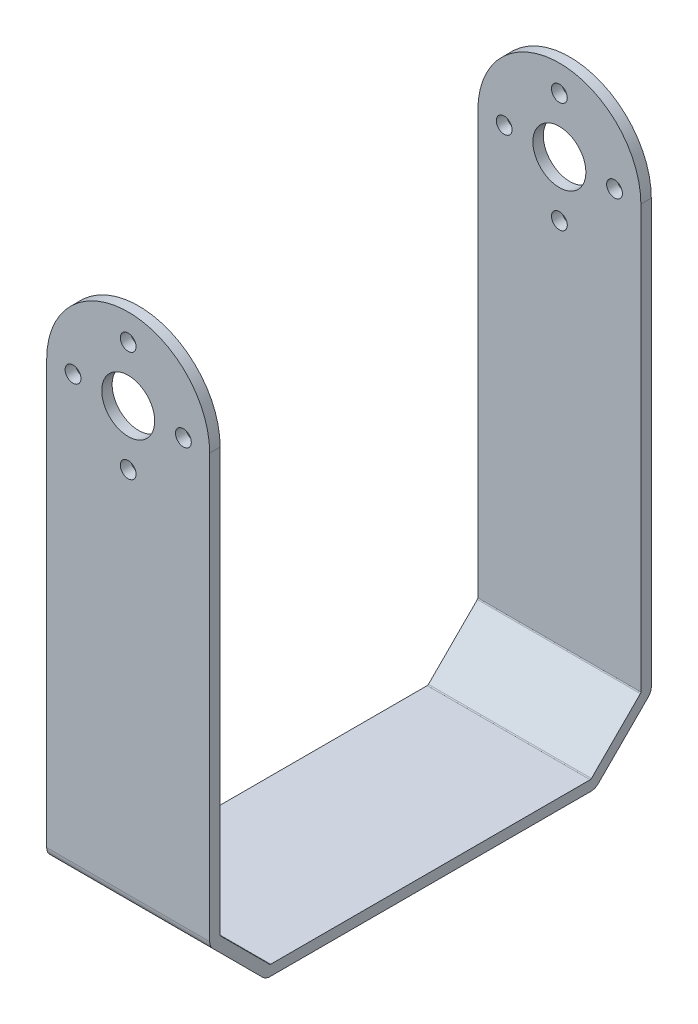
ISO-10303-21;
HEADER;
FILE_DESCRIPTION(('STEP AP214'),'2;1');
FILE_NAME('part.step','',(''),(''),'','','');
FILE_SCHEMA(('AUTOMOTIVE_DESIGN { 1 0 10303 214 1 1 1 1 }'));
ENDSEC;
DATA;
#1=APPLICATION_CONTEXT('core data for automotive mechanical design processes');
#2=APPLICATION_PROTOCOL_DEFINITION('international standard','automotive_design',2000,#1);
#3=PRODUCT_CONTEXT('',#1,'mechanical');
#4=PRODUCT('Part','Part','',(#3));
#5=PRODUCT_RELATED_PRODUCT_CATEGORY('part','',(#4));
#6=PRODUCT_DEFINITION_FORMATION('','',#4);
#7=PRODUCT_DEFINITION_CONTEXT('part definition',#1,'design');
#8=PRODUCT_DEFINITION('design','',#6,#7);
#9=PRODUCT_DEFINITION_SHAPE('','',#8);
#10=(LENGTH_UNIT() NAMED_UNIT(*) SI_UNIT(.MILLI.,.METRE.));
#11=(NAMED_UNIT(*) PLANE_ANGLE_UNIT() SI_UNIT($,.RADIAN.));
#12=(NAMED_UNIT(*) SI_UNIT($,.STERADIAN.) SOLID_ANGLE_UNIT());
#13=UNCERTAINTY_MEASURE_WITH_UNIT(LENGTH_MEASURE(1.E-05),#10,'distance_accuracy_value','');
#14=(GEOMETRIC_REPRESENTATION_CONTEXT(3) GLOBAL_UNCERTAINTY_ASSIGNED_CONTEXT((#13)) GLOBAL_UNIT_ASSIGNED_CONTEXT((#10,
#11,#12)) REPRESENTATION_CONTEXT('',''));
#15=CARTESIAN_POINT('',(0.,0.,0.));
#16=DIRECTION('',(0.,0.,1.));
#17=DIRECTION('',(1.,0.,0.));
#18=AXIS2_PLACEMENT_3D('',#15,#16,#17);
#19=CARTESIAN_POINT('',(24.6126,0.,0.));
#20=DIRECTION('',(0.,0.,-1.));
#21=DIRECTION('',(-1.,0.,0.));
#22=AXIS2_PLACEMENT_3D('',#19,#20,#21);
#23=PLANE('',#22);
#24=CARTESIAN_POINT('',(20.6375,73.025,0.));
#25=DIRECTION('',(0.,0.,1.));
#26=DIRECTION('',(1.,0.,0.));
#27=AXIS2_PLACEMENT_3D('',#24,#25,#26);
#28=CIRCLE('',#27,1.1938);
#29=CARTESIAN_POINT('',(21.8313,73.025,0.));
#30=VERTEX_POINT('',#29);
#31=EDGE_CURVE('E516',#30,#30,#28,.T.);
#32=ORIENTED_EDGE('',*,*,#31,.F.);
#33=EDGE_LOOP('',(#32));
#34=FACE_BOUND('',#33,.T.);
#35=CARTESIAN_POINT('',(12.3063,64.6938,0.));
#36=DIRECTION('',(0.,0.,1.));
#37=DIRECTION('',(1.,0.,0.));
#38=AXIS2_PLACEMENT_3D('',#35,#36,#37);
#39=CIRCLE('',#38,1.1938);
#40=CARTESIAN_POINT('',(13.5001,64.6938,0.));
#41=VERTEX_POINT('',#40);
#42=EDGE_CURVE('E419',#41,#41,#39,.T.);
#43=ORIENTED_EDGE('',*,*,#42,.F.);
#44=EDGE_LOOP('',(#43));
#45=FACE_BOUND('',#44,.T.);
#46=CARTESIAN_POINT('',(3.9751,73.025,0.));
#47=DIRECTION('',(0.,0.,1.));
#48=DIRECTION('',(1.,0.,0.));
#49=AXIS2_PLACEMENT_3D('',#46,#47,#48);
#50=CIRCLE('',#49,1.1938);
#51=CARTESIAN_POINT('',(5.1689,73.025,0.));
#52=VERTEX_POINT('',#51);
#53=EDGE_CURVE('E415',#52,#52,#50,.T.);
#54=ORIENTED_EDGE('',*,*,#53,.F.);
#55=EDGE_LOOP('',(#54));
#56=FACE_BOUND('',#55,.T.);
#57=CARTESIAN_POINT('',(12.3063,81.3562,0.));
#58=DIRECTION('',(0.,0.,1.));
#59=DIRECTION('',(1.,0.,0.));
#60=AXIS2_PLACEMENT_3D('',#57,#58,#59);
#61=CIRCLE('',#60,1.1938);
#62=CARTESIAN_POINT('',(13.5001,81.3562,0.));
#63=VERTEX_POINT('',#62);
#64=EDGE_CURVE('E439',#63,#63,#61,.T.);
#65=ORIENTED_EDGE('',*,*,#64,.F.);
#66=EDGE_LOOP('',(#65));
#67=FACE_BOUND('',#66,.T.);
#68=CARTESIAN_POINT('',(12.3063,73.025,0.));
#69=DIRECTION('',(0.,0.,1.));
#70=DIRECTION('',(1.,0.,0.));
#71=AXIS2_PLACEMENT_3D('',#68,#69,#70);
#72=CIRCLE('',#71,4.0005);
#73=CARTESIAN_POINT('',(16.3068,73.025,0.));
#74=VERTEX_POINT('',#73);
#75=EDGE_CURVE('E449',#74,#74,#72,.T.);
#76=ORIENTED_EDGE('',*,*,#75,.F.);
#77=EDGE_LOOP('',(#76));
#78=FACE_BOUND('',#77,.T.);
#79=DIRECTION('',(0.,-1.,0.));
#80=VECTOR('',#79,1.);
#81=CARTESIAN_POINT('',(0.,0.,0.));
#82=LINE('',#81,#80);
#83=CARTESIAN_POINT('',(0.,73.0123,0.));
#84=VERTEX_POINT('',#83);
#85=CARTESIAN_POINT('',(0.,9.12386051224214,0.));
#86=VERTEX_POINT('',#85);
#87=EDGE_CURVE('E248',#84,#86,#82,.T.);
#88=ORIENTED_EDGE('',*,*,#87,.T.);
#89=DIRECTION('',(1.,0.,0.));
#90=VECTOR('',#89,1.);
#91=CARTESIAN_POINT('',(24.6126,9.12386051224214,0.));
#92=LINE('',#91,#90);
#93=CARTESIAN_POINT('',(24.6126,9.12386051224214,0.));
#94=VERTEX_POINT('',#93);
#95=EDGE_CURVE('E337',#86,#94,#92,.T.);
#96=ORIENTED_EDGE('',*,*,#95,.T.);
#97=DIRECTION('',(0.,-1.,0.));
#98=VECTOR('',#97,1.);
#99=CARTESIAN_POINT('',(24.6126,0.,0.));
#100=LINE('',#99,#98);
#101=CARTESIAN_POINT('',(24.6126,73.0123,0.));
#102=VERTEX_POINT('',#101);
#103=EDGE_CURVE('E186',#102,#94,#100,.T.);
#104=ORIENTED_EDGE('',*,*,#103,.F.);
#105=CARTESIAN_POINT('',(12.3063,73.0123,0.));
#106=DIRECTION('',(0.,0.,1.));
#107=DIRECTION('',(1.,0.,0.));
#108=AXIS2_PLACEMENT_3D('',#105,#106,#107);
#109=CIRCLE('',#108,12.3063);
#110=EDGE_CURVE('E198',#102,#84,#109,.T.);
#111=ORIENTED_EDGE('',*,*,#110,.T.);
#112=EDGE_LOOP('',(#88,#96,#104,#111));
#113=FACE_BOUND('',#112,.T.);
#114=ADVANCED_FACE('F37',(#34,#45,#56,#67,#78,#113),#23,.F.);
#115=CARTESIAN_POINT('',(24.6126,0.,-66.675));
#116=DIRECTION('',(0.,0.,1.));
#117=DIRECTION('',(1.,0.,0.));
#118=AXIS2_PLACEMENT_3D('',#115,#116,#117);
#119=PLANE('',#118);
#120=CARTESIAN_POINT('',(20.6375,73.025,-66.675));
#121=DIRECTION('',(0.,0.,1.));
#122=DIRECTION('',(1.,0.,0.));
#123=AXIS2_PLACEMENT_3D('',#120,#121,#122);
#124=CIRCLE('',#123,1.1938);
#125=CARTESIAN_POINT('',(21.8313,73.025,-66.675));
#126=VERTEX_POINT('',#125);
#127=EDGE_CURVE('E512',#126,#126,#124,.T.);
#128=ORIENTED_EDGE('',*,*,#127,.T.);
#129=EDGE_LOOP('',(#128));
#130=FACE_BOUND('',#129,.T.);
#131=CARTESIAN_POINT('',(12.3063,64.6938,-66.675));
#132=DIRECTION('',(0.,0.,1.));
#133=DIRECTION('',(1.,0.,0.));
#134=AXIS2_PLACEMENT_3D('',#131,#132,#133);
#135=CIRCLE('',#134,1.1938);
#136=CARTESIAN_POINT('',(13.5001,64.6938,-66.675));
#137=VERTEX_POINT('',#136);
#138=EDGE_CURVE('E409',#137,#137,#135,.T.);
#139=ORIENTED_EDGE('',*,*,#138,.T.);
#140=EDGE_LOOP('',(#139));
#141=FACE_BOUND('',#140,.T.);
#142=CARTESIAN_POINT('',(3.9751,73.025,-66.675));
#143=DIRECTION('',(0.,0.,1.));
#144=DIRECTION('',(1.,0.,0.));
#145=AXIS2_PLACEMENT_3D('',#142,#143,#144);
#146=CIRCLE('',#145,1.1938);
#147=CARTESIAN_POINT('',(5.1689,73.025,-66.675));
#148=VERTEX_POINT('',#147);
#149=EDGE_CURVE('E404',#148,#148,#146,.T.);
#150=ORIENTED_EDGE('',*,*,#149,.T.);
#151=EDGE_LOOP('',(#150));
#152=FACE_BOUND('',#151,.T.);
#153=CARTESIAN_POINT('',(12.3063,81.3562,-66.675));
#154=DIRECTION('',(0.,0.,1.));
#155=DIRECTION('',(1.,0.,0.));
#156=AXIS2_PLACEMENT_3D('',#153,#154,#155);
#157=CIRCLE('',#156,1.1938);
#158=CARTESIAN_POINT('',(13.5001,81.3562,-66.675));
#159=VERTEX_POINT('',#158);
#160=EDGE_CURVE('E399',#159,#159,#157,.T.);
#161=ORIENTED_EDGE('',*,*,#160,.T.);
#162=EDGE_LOOP('',(#161));
#163=FACE_BOUND('',#162,.T.);
#164=CARTESIAN_POINT('',(12.3063,73.025,-66.675));
#165=DIRECTION('',(0.,0.,1.));
#166=DIRECTION('',(1.,0.,0.));
#167=AXIS2_PLACEMENT_3D('',#164,#165,#166);
#168=CIRCLE('',#167,4.0005);
#169=CARTESIAN_POINT('',(16.3068,73.025,-66.675));
#170=VERTEX_POINT('',#169);
#171=EDGE_CURVE('E393',#170,#170,#168,.T.);
#172=ORIENTED_EDGE('',*,*,#171,.T.);
#173=EDGE_LOOP('',(#172));
#174=FACE_BOUND('',#173,.T.);
#175=DIRECTION('',(0.,1.,0.));
#176=VECTOR('',#175,1.);
#177=CARTESIAN_POINT('',(24.6126,0.,-66.675));
#178=LINE('',#177,#176);
#179=CARTESIAN_POINT('',(24.6126,9.12386051224214,-66.675));
#180=VERTEX_POINT('',#179);
#181=CARTESIAN_POINT('',(24.6126,73.0123,-66.675));
#182=VERTEX_POINT('',#181);
#183=EDGE_CURVE('E280',#180,#182,#178,.T.);
#184=ORIENTED_EDGE('',*,*,#183,.F.);
#185=DIRECTION('',(1.,0.,0.));
#186=VECTOR('',#185,1.);
#187=CARTESIAN_POINT('',(0.,9.12386051224214,-66.675));
#188=LINE('',#187,#186);
#189=CARTESIAN_POINT('',(0.,9.12386051224214,-66.675));
#190=VERTEX_POINT('',#189);
#191=EDGE_CURVE('E181',#180,#190,#188,.F.);
#192=ORIENTED_EDGE('',*,*,#191,.T.);
#193=DIRECTION('',(0.,1.,0.));
#194=VECTOR('',#193,1.);
#195=CARTESIAN_POINT('',(0.,0.,-66.675));
#196=LINE('',#195,#194);
#197=CARTESIAN_POINT('',(0.,73.0123,-66.675));
#198=VERTEX_POINT('',#197);
#199=EDGE_CURVE('E175',#190,#198,#196,.T.);
#200=ORIENTED_EDGE('',*,*,#199,.T.);
#201=CARTESIAN_POINT('',(12.3063,73.0123,-66.675));
#202=DIRECTION('',(0.,0.,1.));
#203=DIRECTION('',(1.,0.,0.));
#204=AXIS2_PLACEMENT_3D('',#201,#202,#203);
#205=CIRCLE('',#204,12.3063);
#206=EDGE_CURVE('E179',#182,#198,#205,.T.);
#207=ORIENTED_EDGE('',*,*,#206,.F.);
#208=EDGE_LOOP('',(#184,#192,#200,#207));
#209=FACE_BOUND('',#208,.T.);
#210=ADVANCED_FACE('F178',(#130,#141,#152,#163,#174,#209),#119,.F.);
#211=CARTESIAN_POINT('',(0.,85.3186,-1.5748));
#212=DIRECTION('',(0.,0.,-1.));
#213=DIRECTION('',(0.,1.,0.));
#214=AXIS2_PLACEMENT_3D('',#211,#212,#213);
#215=PLANE('',#214);
#216=CARTESIAN_POINT('',(20.6375,73.025,-1.5748));
#217=DIRECTION('',(0.,0.,-1.));
#218=DIRECTION('',(0.,1.,0.));
#219=AXIS2_PLACEMENT_3D('',#216,#217,#218);
#220=CIRCLE('',#219,1.1938);
#221=CARTESIAN_POINT('',(20.6375,74.2188,-1.5748));
#222=VERTEX_POINT('',#221);
#223=EDGE_CURVE('E425',#222,#222,#220,.T.);
#224=ORIENTED_EDGE('',*,*,#223,.F.);
#225=EDGE_LOOP('',(#224));
#226=FACE_BOUND('',#225,.T.);
#227=CARTESIAN_POINT('',(12.3063,64.6938,-1.5748));
#228=DIRECTION('',(0.,0.,-1.));
#229=DIRECTION('',(0.,1.,0.));
#230=AXIS2_PLACEMENT_3D('',#227,#228,#229);
#231=CIRCLE('',#230,1.1938);
#232=CARTESIAN_POINT('',(12.3063,65.8876,-1.5748));
#233=VERTEX_POINT('',#232);
#234=EDGE_CURVE('E408',#233,#233,#231,.T.);
#235=ORIENTED_EDGE('',*,*,#234,.F.);
#236=EDGE_LOOP('',(#235));
#237=FACE_BOUND('',#236,.T.);
#238=CARTESIAN_POINT('',(3.9751,73.025,-1.5748));
#239=DIRECTION('',(0.,0.,-1.));
#240=DIRECTION('',(0.,1.,0.));
#241=AXIS2_PLACEMENT_3D('',#238,#239,#240);
#242=CIRCLE('',#241,1.1938);
#243=CARTESIAN_POINT('',(3.9751,74.2188,-1.5748));
#244=VERTEX_POINT('',#243);
#245=EDGE_CURVE('E403',#244,#244,#242,.T.);
#246=ORIENTED_EDGE('',*,*,#245,.F.);
#247=EDGE_LOOP('',(#246));
#248=FACE_BOUND('',#247,.T.);
#249=CARTESIAN_POINT('',(12.3063,81.3562,-1.5748));
#250=DIRECTION('',(0.,0.,-1.));
#251=DIRECTION('',(0.,1.,0.));
#252=AXIS2_PLACEMENT_3D('',#249,#250,#251);
#253=CIRCLE('',#252,1.1938);
#254=CARTESIAN_POINT('',(12.3063,82.55,-1.5748));
#255=VERTEX_POINT('',#254);
#256=EDGE_CURVE('E398',#255,#255,#253,.T.);
#257=ORIENTED_EDGE('',*,*,#256,.F.);
#258=EDGE_LOOP('',(#257));
#259=FACE_BOUND('',#258,.T.);
#260=CARTESIAN_POINT('',(12.3063,73.025,-1.5748));
#261=DIRECTION('',(0.,0.,-1.));
#262=DIRECTION('',(0.,1.,0.));
#263=AXIS2_PLACEMENT_3D('',#260,#261,#262);
#264=CIRCLE('',#263,4.0005);
#265=CARTESIAN_POINT('',(12.3063,77.0255,-1.5748));
#266=VERTEX_POINT('',#265);
#267=EDGE_CURVE('E392',#266,#266,#264,.T.);
#268=ORIENTED_EDGE('',*,*,#267,.F.);
#269=EDGE_LOOP('',(#268));
#270=FACE_BOUND('',#269,.T.);
#271=DIRECTION('',(0.,1.,0.));
#272=VECTOR('',#271,1.);
#273=CARTESIAN_POINT('',(24.6126,85.3186,-1.5748));
#274=LINE('',#273,#272);
#275=CARTESIAN_POINT('',(24.6126,9.22381024484277,-1.57480000000001));
#276=VERTEX_POINT('',#275);
#277=CARTESIAN_POINT('',(24.6126,73.0123,-1.5748));
#278=VERTEX_POINT('',#277);
#279=EDGE_CURVE('E227',#276,#278,#274,.T.);
#280=ORIENTED_EDGE('',*,*,#279,.F.);
#281=DIRECTION('',(1.,0.,0.));
#282=VECTOR('',#281,1.);
#283=CARTESIAN_POINT('',(0.,9.22381024484277,-1.57480000000001));
#284=LINE('',#283,#282);
#285=CARTESIAN_POINT('',(0.,9.22381024484277,-1.57480000000001));
#286=VERTEX_POINT('',#285);
#287=EDGE_CURVE('E61',#276,#286,#284,.F.);
#288=ORIENTED_EDGE('',*,*,#287,.T.);
#289=DIRECTION('',(0.,1.,0.));
#290=VECTOR('',#289,1.);
#291=CARTESIAN_POINT('',(0.,85.3186,-1.5748));
#292=LINE('',#291,#290);
#293=CARTESIAN_POINT('',(0.,73.0123,-1.5748));
#294=VERTEX_POINT('',#293);
#295=EDGE_CURVE('E245',#286,#294,#292,.T.);
#296=ORIENTED_EDGE('',*,*,#295,.T.);
#297=CARTESIAN_POINT('',(12.3063,73.0123,-1.5748));
#298=DIRECTION('',(0.,0.,-1.));
#299=DIRECTION('',(0.,1.,0.));
#300=AXIS2_PLACEMENT_3D('',#297,#298,#299);
#301=CIRCLE('',#300,12.3063);
#302=EDGE_CURVE('E217',#294,#278,#301,.T.);
#303=ORIENTED_EDGE('',*,*,#302,.T.);
#304=EDGE_LOOP('',(#280,#288,#296,#303));
#305=FACE_BOUND('',#304,.T.);
#306=ADVANCED_FACE('F474',(#226,#237,#248,#259,#270,#305),#215,.T.);
#307=CARTESIAN_POINT('',(0.,9.1186,-65.1002));
#308=DIRECTION('',(0.,0.,1.));
#309=DIRECTION('',(1.,0.,0.));
#310=AXIS2_PLACEMENT_3D('',#307,#308,#309);
#311=PLANE('',#310);
#312=CARTESIAN_POINT('',(20.6375,73.025,-65.1002));
#313=DIRECTION('',(0.,0.,1.));
#314=DIRECTION('',(1.,0.,0.));
#315=AXIS2_PLACEMENT_3D('',#312,#313,#314);
#316=CIRCLE('',#315,1.1938);
#317=CARTESIAN_POINT('',(21.8313,73.025,-65.1002));
#318=VERTEX_POINT('',#317);
#319=EDGE_CURVE('E41',#318,#318,#316,.T.);
#320=ORIENTED_EDGE('',*,*,#319,.F.);
#321=EDGE_LOOP('',(#320));
#322=FACE_BOUND('',#321,.T.);
#323=CARTESIAN_POINT('',(12.3063,64.6938,-65.1002));
#324=DIRECTION('',(0.,0.,1.));
#325=DIRECTION('',(1.,0.,0.));
#326=AXIS2_PLACEMENT_3D('',#323,#324,#325);
#327=CIRCLE('',#326,1.1938);
#328=CARTESIAN_POINT('',(13.5001,64.6938,-65.1002));
#329=VERTEX_POINT('',#328);
#330=EDGE_CURVE('E405',#329,#329,#327,.T.);
#331=ORIENTED_EDGE('',*,*,#330,.F.);
#332=EDGE_LOOP('',(#331));
#333=FACE_BOUND('',#332,.T.);
#334=CARTESIAN_POINT('',(3.9751,73.025,-65.1002));
#335=DIRECTION('',(0.,0.,1.));
#336=DIRECTION('',(1.,0.,0.));
#337=AXIS2_PLACEMENT_3D('',#334,#335,#336);
#338=CIRCLE('',#337,1.1938);
#339=CARTESIAN_POINT('',(5.1689,73.025,-65.1002));
#340=VERTEX_POINT('',#339);
#341=EDGE_CURVE('E400',#340,#340,#338,.T.);
#342=ORIENTED_EDGE('',*,*,#341,.F.);
#343=EDGE_LOOP('',(#342));
#344=FACE_BOUND('',#343,.T.);
#345=CARTESIAN_POINT('',(12.3063,81.3562,-65.1002));
#346=DIRECTION('',(0.,0.,1.));
#347=DIRECTION('',(1.,0.,0.));
#348=AXIS2_PLACEMENT_3D('',#345,#346,#347);
#349=CIRCLE('',#348,1.1938);
#350=CARTESIAN_POINT('',(13.5001,81.3562,-65.1002));
#351=VERTEX_POINT('',#350);
#352=EDGE_CURVE('E394',#351,#351,#349,.T.);
#353=ORIENTED_EDGE('',*,*,#352,.F.);
#354=EDGE_LOOP('',(#353));
#355=FACE_BOUND('',#354,.T.);
#356=CARTESIAN_POINT('',(12.3063,73.025,-65.1002));
#357=DIRECTION('',(0.,0.,1.));
#358=DIRECTION('',(1.,0.,0.));
#359=AXIS2_PLACEMENT_3D('',#356,#357,#358);
#360=CIRCLE('',#359,4.0005);
#361=CARTESIAN_POINT('',(16.3068,73.025,-65.1002));
#362=VERTEX_POINT('',#361);
#363=EDGE_CURVE('E388',#362,#362,#360,.T.);
#364=ORIENTED_EDGE('',*,*,#363,.F.);
#365=EDGE_LOOP('',(#364));
#366=FACE_BOUND('',#365,.T.);
#367=DIRECTION('',(0.,-1.,0.));
#368=VECTOR('',#367,1.);
#369=CARTESIAN_POINT('',(0.,9.1186,-65.1002));
#370=LINE('',#369,#368);
#371=CARTESIAN_POINT('',(0.,73.0123,-65.1002));
#372=VERTEX_POINT('',#371);
#373=CARTESIAN_POINT('',(0.,9.22381024484276,-65.1002));
#374=VERTEX_POINT('',#373);
#375=EDGE_CURVE('E204',#372,#374,#370,.T.);
#376=ORIENTED_EDGE('',*,*,#375,.T.);
#377=DIRECTION('',(1.,0.,0.));
#378=VECTOR('',#377,1.);
#379=CARTESIAN_POINT('',(24.6126,9.22381024484276,-65.1002));
#380=LINE('',#379,#378);
#381=CARTESIAN_POINT('',(24.6126,9.22381024484276,-65.1002));
#382=VERTEX_POINT('',#381);
#383=EDGE_CURVE('E341',#374,#382,#380,.T.);
#384=ORIENTED_EDGE('',*,*,#383,.T.);
#385=DIRECTION('',(0.,-1.,0.));
#386=VECTOR('',#385,1.);
#387=CARTESIAN_POINT('',(24.6126,9.1186,-65.1002));
#388=LINE('',#387,#386);
#389=CARTESIAN_POINT('',(24.6126,73.0123,-65.1002));
#390=VERTEX_POINT('',#389);
#391=EDGE_CURVE('E256',#390,#382,#388,.T.);
#392=ORIENTED_EDGE('',*,*,#391,.F.);
#393=CARTESIAN_POINT('',(12.3063,73.0123,-65.1002));
#394=DIRECTION('',(0.,0.,1.));
#395=DIRECTION('',(1.,0.,0.));
#396=AXIS2_PLACEMENT_3D('',#393,#394,#395);
#397=CIRCLE('',#396,12.3063);
#398=EDGE_CURVE('E283',#390,#372,#397,.T.);
#399=ORIENTED_EDGE('',*,*,#398,.T.);
#400=EDGE_LOOP('',(#376,#384,#392,#399));
#401=FACE_BOUND('',#400,.T.);
#402=ADVANCED_FACE('F507',(#322,#333,#344,#355,#366,#401),#311,.T.);
#403=CARTESIAN_POINT('',(24.6126,0.,0.));
#404=DIRECTION('',(0.,1.,0.));
#405=DIRECTION('',(0.,0.,1.));
#406=AXIS2_PLACEMENT_3D('',#403,#404,#405);
#407=PLANE('',#406);
#408=DIRECTION('',(0.,0.,-1.));
#409=VECTOR('',#408,1.);
#410=CARTESIAN_POINT('',(0.,0.,0.));
#411=LINE('',#410,#409);
#412=CARTESIAN_POINT('',(0.,0.,-9.12386051224214));
#413=VERTEX_POINT('',#412);
#414=CARTESIAN_POINT('',(0.,0.,-57.5511394877579));
#415=VERTEX_POINT('',#414);
#416=EDGE_CURVE('E187',#413,#415,#411,.T.);
#417=ORIENTED_EDGE('',*,*,#416,.T.);
#418=DIRECTION('',(1.,0.,0.));
#419=VECTOR('',#418,1.);
#420=CARTESIAN_POINT('',(24.6126,0.,-57.5511394877579));
#421=LINE('',#420,#419);
#422=CARTESIAN_POINT('',(24.6126,0.,-57.5511394877579));
#423=VERTEX_POINT('',#422);
#424=EDGE_CURVE('E295',#415,#423,#421,.T.);
#425=ORIENTED_EDGE('',*,*,#424,.T.);
#426=DIRECTION('',(0.,0.,-1.));
#427=VECTOR('',#426,1.);
#428=CARTESIAN_POINT('',(24.6126,0.,0.));
#429=LINE('',#428,#427);
#430=CARTESIAN_POINT('',(24.6126,0.,-9.12386051224214));
#431=VERTEX_POINT('',#430);
#432=EDGE_CURVE('E276',#431,#423,#429,.T.);
#433=ORIENTED_EDGE('',*,*,#432,.F.);
#434=DIRECTION('',(1.,0.,0.));
#435=VECTOR('',#434,1.);
#436=CARTESIAN_POINT('',(0.,0.,-9.12386051224214));
#437=LINE('',#436,#435);
#438=EDGE_CURVE('E292',#431,#413,#437,.F.);
#439=ORIENTED_EDGE('',*,*,#438,.T.);
#440=EDGE_LOOP('',(#417,#425,#433,#439));
#441=FACE_BOUND('',#440,.T.);
#442=ADVANCED_FACE('F566',(#441),#407,.F.);
#443=CARTESIAN_POINT('',(24.6126,85.3186,0.));
#444=DIRECTION('',(-1.,0.,0.));
#445=DIRECTION('',(0.,0.,1.));
#446=AXIS2_PLACEMENT_3D('',#443,#444,#445);
#447=PLANE('',#446);
#448=ORIENTED_EDGE('',*,*,#432,.T.);
#449=CARTESIAN_POINT('',(24.6126,1.5875,-57.5511394877579));
#450=DIRECTION('',(-1.,0.,0.));
#451=DIRECTION('',(0.,0.,1.));
#452=AXIS2_PLACEMENT_3D('',#449,#450,#451);
#453=CIRCLE('',#452,1.5875);
#454=CARTESIAN_POINT('',(24.6126,0.464967984866358,-58.6736715028915));
#455=VERTEX_POINT('',#454);
#456=EDGE_CURVE('E307',#423,#455,#453,.F.);
#457=ORIENTED_EDGE('',*,*,#456,.T.);
#458=DIRECTION('',(0.,0.707106781186548,-0.707106781186547));
#459=VECTOR('',#458,1.);
#460=CARTESIAN_POINT('',(24.6126,0.,-58.2087035180252));
#461=LINE('',#460,#459);
#462=CARTESIAN_POINT('',(24.6126,8.00132849710849,-66.2100320151336));
#463=VERTEX_POINT('',#462);
#464=EDGE_CURVE('E252',#455,#463,#461,.T.);
#465=ORIENTED_EDGE('',*,*,#464,.T.);
#466=CARTESIAN_POINT('',(24.6126,9.12386051224214,-65.0875));
#467=DIRECTION('',(-1.,0.,0.));
#468=DIRECTION('',(0.,0.,1.));
#469=AXIS2_PLACEMENT_3D('',#466,#467,#468);
#470=CIRCLE('',#469,1.5875);
#471=EDGE_CURVE('E304',#463,#180,#470,.F.);
#472=ORIENTED_EDGE('',*,*,#471,.T.);
#473=ORIENTED_EDGE('',*,*,#183,.T.);
#474=DIRECTION('',(0.,0.,1.));
#475=VECTOR('',#474,1.);
#476=CARTESIAN_POINT('',(24.6126,73.0123,-66.675));
#477=LINE('',#476,#475);
#478=EDGE_CURVE('E195',#182,#390,#477,.T.);
#479=ORIENTED_EDGE('',*,*,#478,.T.);
#480=ORIENTED_EDGE('',*,*,#391,.T.);
#481=CARTESIAN_POINT('',(24.6126,9.22381024484276,-64.8462));
#482=DIRECTION('',(-1.,0.,0.));
#483=DIRECTION('',(0.,0.,1.));
#484=AXIS2_PLACEMENT_3D('',#481,#482,#483);
#485=CIRCLE('',#484,0.254);
#486=CARTESIAN_POINT('',(24.6126,9.04420512242137,-65.0258051224214));
#487=VERTEX_POINT('',#486);
#488=EDGE_CURVE('E368',#382,#487,#485,.T.);
#489=ORIENTED_EDGE('',*,*,#488,.T.);
#490=DIRECTION('',(0.,-0.707106781186548,0.707106781186547));
#491=VECTOR('',#490,1.);
#492=CARTESIAN_POINT('',(24.6126,9.1186,-65.1002));
#493=LINE('',#492,#491);
#494=CARTESIAN_POINT('',(24.6126,1.64919487757862,-57.6307948775786));
#495=VERTEX_POINT('',#494);
#496=EDGE_CURVE('E260',#487,#495,#493,.T.);
#497=ORIENTED_EDGE('',*,*,#496,.T.);
#498=CARTESIAN_POINT('',(24.6126,1.8288,-57.4511897551572));
#499=DIRECTION('',(-1.,0.,0.));
#500=DIRECTION('',(0.,0.,1.));
#501=AXIS2_PLACEMENT_3D('',#498,#499,#500);
#502=CIRCLE('',#501,0.254);
#503=CARTESIAN_POINT('',(24.6126,1.5748,-57.4511897551572));
#504=VERTEX_POINT('',#503);
#505=EDGE_CURVE('E374',#495,#504,#502,.T.);
#506=ORIENTED_EDGE('',*,*,#505,.T.);
#507=DIRECTION('',(0.,0.,1.));
#508=VECTOR('',#507,1.);
#509=CARTESIAN_POINT('',(24.6126,1.5748,-9.1186));
#510=LINE('',#509,#508);
#511=CARTESIAN_POINT('',(24.6126,1.5748,-9.22381024484277));
#512=VERTEX_POINT('',#511);
#513=EDGE_CURVE('E264',#504,#512,#510,.T.);
#514=ORIENTED_EDGE('',*,*,#513,.T.);
#515=CARTESIAN_POINT('',(24.6126,1.8288,-9.22381024484277));
#516=DIRECTION('',(-1.,0.,0.));
#517=DIRECTION('',(0.,0.,1.));
#518=AXIS2_PLACEMENT_3D('',#515,#516,#517);
#519=CIRCLE('',#518,0.254);
#520=CARTESIAN_POINT('',(24.6126,1.64919487757862,-9.04420512242138));
#521=VERTEX_POINT('',#520);
#522=EDGE_CURVE('E380',#512,#521,#519,.T.);
#523=ORIENTED_EDGE('',*,*,#522,.T.);
#524=DIRECTION('',(0.,0.707106781186548,0.707106781186547));
#525=VECTOR('',#524,1.);
#526=CARTESIAN_POINT('',(24.6126,9.1186,-1.57480000000001));
#527=LINE('',#526,#525);
#528=CARTESIAN_POINT('',(24.6126,9.04420512242138,-1.64919487757862));
#529=VERTEX_POINT('',#528);
#530=EDGE_CURVE('E268',#521,#529,#527,.T.);
#531=ORIENTED_EDGE('',*,*,#530,.T.);
#532=CARTESIAN_POINT('',(24.6126,9.22381024484277,-1.82880000000001));
#533=DIRECTION('',(-1.,0.,0.));
#534=DIRECTION('',(0.,0.,1.));
#535=AXIS2_PLACEMENT_3D('',#532,#533,#534);
#536=CIRCLE('',#535,0.254);
#537=EDGE_CURVE('E47',#529,#276,#536,.T.);
#538=ORIENTED_EDGE('',*,*,#537,.T.);
#539=ORIENTED_EDGE('',*,*,#279,.T.);
#540=EDGE_CURVE('E206',#278,#102,#477,.T.);
#541=ORIENTED_EDGE('',*,*,#540,.T.);
#542=ORIENTED_EDGE('',*,*,#103,.T.);
#543=CARTESIAN_POINT('',(24.6126,9.12386051224214,-1.5875));
#544=DIRECTION('',(-1.,0.,0.));
#545=DIRECTION('',(0.,0.,1.));
#546=AXIS2_PLACEMENT_3D('',#543,#544,#545);
#547=CIRCLE('',#546,1.5875);
#548=CARTESIAN_POINT('',(24.6126,8.00132849710849,-0.464967984866355));
#549=VERTEX_POINT('',#548);
#550=EDGE_CURVE('E299',#94,#549,#547,.F.);
#551=ORIENTED_EDGE('',*,*,#550,.T.);
#552=DIRECTION('',(0.,-0.707106781186547,-0.707106781186548));
#553=VECTOR('',#552,1.);
#554=CARTESIAN_POINT('',(24.6126,8.46629648197485,0.));
#555=LINE('',#554,#553);
#556=CARTESIAN_POINT('',(24.6126,0.464967984866357,-8.00132849710849));
#557=VERTEX_POINT('',#556);
#558=EDGE_CURVE('E221',#549,#557,#555,.T.);
#559=ORIENTED_EDGE('',*,*,#558,.T.);
#560=CARTESIAN_POINT('',(24.6126,1.5875,-9.12386051224214));
#561=DIRECTION('',(-1.,0.,0.));
#562=DIRECTION('',(0.,0.,1.));
#563=AXIS2_PLACEMENT_3D('',#560,#561,#562);
#564=CIRCLE('',#563,1.5875);
#565=EDGE_CURVE('E302',#557,#431,#564,.F.);
#566=ORIENTED_EDGE('',*,*,#565,.T.);
#567=EDGE_LOOP('',(#448,#457,#465,#472,#473,#479,#480,#489,#497,#506,#514,#523,#531,#538,#539,
#541,#542,#551,#559,#566));
#568=FACE_BOUND('',#567,.T.);
#569=ADVANCED_FACE('F472',(#568),#447,.F.);
#570=CARTESIAN_POINT('',(0.,85.3186,0.));
#571=DIRECTION('',(-1.,0.,0.));
#572=DIRECTION('',(0.,0.,1.));
#573=AXIS2_PLACEMENT_3D('',#570,#571,#572);
#574=PLANE('',#573);
#575=DIRECTION('',(0.,0.707106781186548,-0.707106781186547));
#576=VECTOR('',#575,1.);
#577=CARTESIAN_POINT('',(0.,0.,-58.2087035180252));
#578=LINE('',#577,#576);
#579=CARTESIAN_POINT('',(0.,0.464967984866358,-58.6736715028915));
#580=VERTEX_POINT('',#579);
#581=CARTESIAN_POINT('',(0.,8.00132849710849,-66.2100320151336));
#582=VERTEX_POINT('',#581);
#583=EDGE_CURVE('E226',#580,#582,#578,.T.);
#584=ORIENTED_EDGE('',*,*,#583,.F.);
#585=CARTESIAN_POINT('',(0.,1.5875,-57.5511394877579));
#586=DIRECTION('',(-1.,0.,0.));
#587=DIRECTION('',(0.,0.,1.));
#588=AXIS2_PLACEMENT_3D('',#585,#586,#587);
#589=CIRCLE('',#588,1.5875);
#590=EDGE_CURVE('E326',#580,#415,#589,.T.);
#591=ORIENTED_EDGE('',*,*,#590,.T.);
#592=ORIENTED_EDGE('',*,*,#416,.F.);
#593=CARTESIAN_POINT('',(0.,1.5875,-9.12386051224214));
#594=DIRECTION('',(-1.,0.,0.));
#595=DIRECTION('',(0.,0.,1.));
#596=AXIS2_PLACEMENT_3D('',#593,#594,#595);
#597=CIRCLE('',#596,1.5875);
#598=CARTESIAN_POINT('',(0.,0.464967984866357,-8.00132849710849));
#599=VERTEX_POINT('',#598);
#600=EDGE_CURVE('E320',#413,#599,#597,.T.);
#601=ORIENTED_EDGE('',*,*,#600,.T.);
#602=DIRECTION('',(0.,-0.707106781186547,-0.707106781186548));
#603=VECTOR('',#602,1.);
#604=CARTESIAN_POINT('',(0.,8.46629648197485,0.));
#605=LINE('',#604,#603);
#606=CARTESIAN_POINT('',(0.,8.00132849710849,-0.464967984866355));
#607=VERTEX_POINT('',#606);
#608=EDGE_CURVE('E222',#607,#599,#605,.T.);
#609=ORIENTED_EDGE('',*,*,#608,.F.);
#610=CARTESIAN_POINT('',(0.,9.12386051224214,-1.5875));
#611=DIRECTION('',(-1.,0.,0.));
#612=DIRECTION('',(0.,0.,1.));
#613=AXIS2_PLACEMENT_3D('',#610,#611,#612);
#614=CIRCLE('',#613,1.5875);
#615=EDGE_CURVE('E317',#607,#86,#614,.T.);
#616=ORIENTED_EDGE('',*,*,#615,.T.);
#617=ORIENTED_EDGE('',*,*,#87,.F.);
#618=DIRECTION('',(0.,0.,1.));
#619=VECTOR('',#618,1.);
#620=CARTESIAN_POINT('',(0.,73.0123,-66.675));
#621=LINE('',#620,#619);
#622=EDGE_CURVE('E197',#294,#84,#621,.T.);
#623=ORIENTED_EDGE('',*,*,#622,.F.);
#624=ORIENTED_EDGE('',*,*,#295,.F.);
#625=CARTESIAN_POINT('',(0.,9.22381024484277,-1.82880000000001));
#626=DIRECTION('',(-1.,0.,0.));
#627=DIRECTION('',(0.,0.,1.));
#628=AXIS2_PLACEMENT_3D('',#625,#626,#627);
#629=CIRCLE('',#628,0.254);
#630=CARTESIAN_POINT('',(0.,9.04420512242138,-1.64919487757862));
#631=VERTEX_POINT('',#630);
#632=EDGE_CURVE('E12',#286,#631,#629,.F.);
#633=ORIENTED_EDGE('',*,*,#632,.T.);
#634=DIRECTION('',(0.,0.707106781186548,0.707106781186547));
#635=VECTOR('',#634,1.);
#636=CARTESIAN_POINT('',(0.,9.1186,-1.57480000000001));
#637=LINE('',#636,#635);
#638=CARTESIAN_POINT('',(0.,1.64919487757862,-9.04420512242138));
#639=VERTEX_POINT('',#638);
#640=EDGE_CURVE('E241',#639,#631,#637,.T.);
#641=ORIENTED_EDGE('',*,*,#640,.F.);
#642=CARTESIAN_POINT('',(0.,1.8288,-9.22381024484277));
#643=DIRECTION('',(-1.,0.,0.));
#644=DIRECTION('',(0.,0.,1.));
#645=AXIS2_PLACEMENT_3D('',#642,#643,#644);
#646=CIRCLE('',#645,0.254);
#647=CARTESIAN_POINT('',(0.,1.5748,-9.22381024484277));
#648=VERTEX_POINT('',#647);
#649=EDGE_CURVE('E383',#639,#648,#646,.F.);
#650=ORIENTED_EDGE('',*,*,#649,.T.);
#651=DIRECTION('',(0.,0.,1.));
#652=VECTOR('',#651,1.);
#653=CARTESIAN_POINT('',(0.,1.5748,-9.1186));
#654=LINE('',#653,#652);
#655=CARTESIAN_POINT('',(0.,1.5748,-57.4511897551572));
#656=VERTEX_POINT('',#655);
#657=EDGE_CURVE('E237',#656,#648,#654,.T.);
#658=ORIENTED_EDGE('',*,*,#657,.F.);
#659=CARTESIAN_POINT('',(0.,1.8288,-57.4511897551572));
#660=DIRECTION('',(-1.,0.,0.));
#661=DIRECTION('',(0.,0.,1.));
#662=AXIS2_PLACEMENT_3D('',#659,#660,#661);
#663=CIRCLE('',#662,0.254);
#664=CARTESIAN_POINT('',(0.,1.64919487757862,-57.6307948775786));
#665=VERTEX_POINT('',#664);
#666=EDGE_CURVE('E377',#656,#665,#663,.F.);
#667=ORIENTED_EDGE('',*,*,#666,.T.);
#668=DIRECTION('',(0.,-0.707106781186548,0.707106781186547));
#669=VECTOR('',#668,1.);
#670=CARTESIAN_POINT('',(0.,9.1186,-65.1002));
#671=LINE('',#670,#669);
#672=CARTESIAN_POINT('',(0.,9.04420512242137,-65.0258051224214));
#673=VERTEX_POINT('',#672);
#674=EDGE_CURVE('E233',#673,#665,#671,.T.);
#675=ORIENTED_EDGE('',*,*,#674,.F.);
#676=CARTESIAN_POINT('',(0.,9.22381024484276,-64.8462));
#677=DIRECTION('',(-1.,0.,0.));
#678=DIRECTION('',(0.,0.,1.));
#679=AXIS2_PLACEMENT_3D('',#676,#677,#678);
#680=CIRCLE('',#679,0.254);
#681=EDGE_CURVE('E371',#673,#374,#680,.F.);
#682=ORIENTED_EDGE('',*,*,#681,.T.);
#683=ORIENTED_EDGE('',*,*,#375,.F.);
#684=EDGE_CURVE('E192',#198,#372,#621,.T.);
#685=ORIENTED_EDGE('',*,*,#684,.F.);
#686=ORIENTED_EDGE('',*,*,#199,.F.);
#687=CARTESIAN_POINT('',(0.,9.12386051224214,-65.0875));
#688=DIRECTION('',(-1.,0.,0.));
#689=DIRECTION('',(0.,0.,1.));
#690=AXIS2_PLACEMENT_3D('',#687,#688,#689);
#691=CIRCLE('',#690,1.5875);
#692=EDGE_CURVE('E323',#190,#582,#691,.T.);
#693=ORIENTED_EDGE('',*,*,#692,.T.);
#694=EDGE_LOOP('',(#584,#591,#592,#601,#609,#616,#617,#623,#624,#633,#641,#650,#658,#667,#675,
#682,#683,#685,#686,#693));
#695=FACE_BOUND('',#694,.T.);
#696=ADVANCED_FACE('F202',(#695),#574,.T.);
#697=CARTESIAN_POINT('',(0.,8.46629648197485,0.));
#698=DIRECTION('',(0.,-0.707106781186548,0.707106781186547));
#699=DIRECTION('',(0.,-0.707106781186547,-0.707106781186548));
#700=AXIS2_PLACEMENT_3D('',#697,#698,#699);
#701=PLANE('',#700);
#702=ORIENTED_EDGE('',*,*,#608,.T.);
#703=DIRECTION('',(1.,0.,0.));
#704=VECTOR('',#703,1.);
#705=CARTESIAN_POINT('',(24.6126,0.464967984866357,-8.0013284971085));
#706=LINE('',#705,#704);
#707=EDGE_CURVE('E334',#599,#557,#706,.T.);
#708=ORIENTED_EDGE('',*,*,#707,.T.);
#709=ORIENTED_EDGE('',*,*,#558,.F.);
#710=DIRECTION('',(1.,0.,0.));
#711=VECTOR('',#710,1.);
#712=CARTESIAN_POINT('',(0.,8.00132849710849,-0.464967984866355));
#713=LINE('',#712,#711);
#714=EDGE_CURVE('E331',#549,#607,#713,.F.);
#715=ORIENTED_EDGE('',*,*,#714,.T.);
#716=EDGE_LOOP('',(#702,#708,#709,#715));
#717=FACE_BOUND('',#716,.T.);
#718=ADVANCED_FACE('F570',(#717),#701,.T.);
#719=CARTESIAN_POINT('',(0.,0.,-58.2087035180252));
#720=DIRECTION('',(0.,-0.707106781186547,-0.707106781186548));
#721=DIRECTION('',(0.,0.707106781186548,-0.707106781186547));
#722=AXIS2_PLACEMENT_3D('',#719,#720,#721);
#723=PLANE('',#722);
#724=ORIENTED_EDGE('',*,*,#464,.F.);
#725=DIRECTION('',(1.,0.,0.));
#726=VECTOR('',#725,1.);
#727=CARTESIAN_POINT('',(0.,0.464967984866357,-58.6736715028915));
#728=LINE('',#727,#726);
#729=EDGE_CURVE('E314',#455,#580,#728,.F.);
#730=ORIENTED_EDGE('',*,*,#729,.T.);
#731=ORIENTED_EDGE('',*,*,#583,.T.);
#732=DIRECTION('',(1.,0.,0.));
#733=VECTOR('',#732,1.);
#734=CARTESIAN_POINT('',(24.6126,8.00132849710849,-66.2100320151336));
#735=LINE('',#734,#733);
#736=EDGE_CURVE('E310',#582,#463,#735,.T.);
#737=ORIENTED_EDGE('',*,*,#736,.T.);
#738=EDGE_LOOP('',(#724,#730,#731,#737));
#739=FACE_BOUND('',#738,.T.);
#740=ADVANCED_FACE('F559',(#739),#723,.T.);
#741=CARTESIAN_POINT('',(0.,9.1186,-1.57480000000001));
#742=DIRECTION('',(0.,0.707106781186547,-0.707106781186548));
#743=DIRECTION('',(0.,0.707106781186548,0.707106781186547));
#744=AXIS2_PLACEMENT_3D('',#741,#742,#743);
#745=PLANE('',#744);
#746=ORIENTED_EDGE('',*,*,#530,.F.);
#747=DIRECTION('',(1.,0.,0.));
#748=VECTOR('',#747,1.);
#749=CARTESIAN_POINT('',(0.,1.64919487757862,-9.04420512242138));
#750=LINE('',#749,#748);
#751=EDGE_CURVE('E363',#521,#639,#750,.F.);
#752=ORIENTED_EDGE('',*,*,#751,.T.);
#753=ORIENTED_EDGE('',*,*,#640,.T.);
#754=DIRECTION('',(1.,0.,0.));
#755=VECTOR('',#754,1.);
#756=CARTESIAN_POINT('',(24.6126,9.04420512242138,-1.64919487757862));
#757=LINE('',#756,#755);
#758=EDGE_CURVE('E359',#631,#529,#757,.T.);
#759=ORIENTED_EDGE('',*,*,#758,.T.);
#760=EDGE_LOOP('',(#746,#752,#753,#759));
#761=FACE_BOUND('',#760,.T.);
#762=ADVANCED_FACE('F481',(#761),#745,.T.);
#763=CARTESIAN_POINT('',(0.,1.5748,-9.1186));
#764=DIRECTION('',(0.,1.,0.));
#765=DIRECTION('',(0.,0.,1.));
#766=AXIS2_PLACEMENT_3D('',#763,#764,#765);
#767=PLANE('',#766);
#768=ORIENTED_EDGE('',*,*,#513,.F.);
#769=DIRECTION('',(1.,0.,0.));
#770=VECTOR('',#769,1.);
#771=CARTESIAN_POINT('',(0.,1.5748,-57.4511897551572));
#772=LINE('',#771,#770);
#773=EDGE_CURVE('E356',#504,#656,#772,.F.);
#774=ORIENTED_EDGE('',*,*,#773,.T.);
#775=ORIENTED_EDGE('',*,*,#657,.T.);
#776=DIRECTION('',(1.,0.,0.));
#777=VECTOR('',#776,1.);
#778=CARTESIAN_POINT('',(24.6126,1.5748,-9.22381024484277));
#779=LINE('',#778,#777);
#780=EDGE_CURVE('E352',#648,#512,#779,.T.);
#781=ORIENTED_EDGE('',*,*,#780,.T.);
#782=EDGE_LOOP('',(#768,#774,#775,#781));
#783=FACE_BOUND('',#782,.T.);
#784=ADVANCED_FACE('F489',(#783),#767,.T.);
#785=CARTESIAN_POINT('',(0.,9.1186,-65.1002));
#786=DIRECTION('',(0.,0.707106781186547,0.707106781186548));
#787=DIRECTION('',(0.,-0.707106781186548,0.707106781186547));
#788=AXIS2_PLACEMENT_3D('',#785,#786,#787);
#789=PLANE('',#788);
#790=ORIENTED_EDGE('',*,*,#496,.F.);
#791=DIRECTION('',(1.,0.,0.));
#792=VECTOR('',#791,1.);
#793=CARTESIAN_POINT('',(0.,9.04420512242137,-65.0258051224214));
#794=LINE('',#793,#792);
#795=EDGE_CURVE('E349',#487,#673,#794,.F.);
#796=ORIENTED_EDGE('',*,*,#795,.T.);
#797=ORIENTED_EDGE('',*,*,#674,.T.);
#798=DIRECTION('',(1.,0.,0.));
#799=VECTOR('',#798,1.);
#800=CARTESIAN_POINT('',(24.6126,1.64919487757862,-57.6307948775786));
#801=LINE('',#800,#799);
#802=EDGE_CURVE('E345',#665,#495,#801,.T.);
#803=ORIENTED_EDGE('',*,*,#802,.T.);
#804=EDGE_LOOP('',(#790,#796,#797,#803));
#805=FACE_BOUND('',#804,.T.);
#806=ADVANCED_FACE('F499',(#805),#789,.T.);
#807=CARTESIAN_POINT('',(12.3063,73.0123,-66.675));
#808=DIRECTION('',(0.,0.,1.));
#809=DIRECTION('',(1.,0.,0.));
#810=AXIS2_PLACEMENT_3D('',#807,#808,#809);
#811=CYLINDRICAL_SURFACE('',#810,12.3063);
#812=ORIENTED_EDGE('',*,*,#206,.T.);
#813=ORIENTED_EDGE('',*,*,#684,.T.);
#814=ORIENTED_EDGE('',*,*,#398,.F.);
#815=ORIENTED_EDGE('',*,*,#478,.F.);
#816=EDGE_LOOP('',(#812,#813,#814,#815));
#817=FACE_BOUND('',#816,.T.);
#818=ADVANCED_FACE('F191',(#817),#811,.T.);
#819=ORIENTED_EDGE('',*,*,#302,.F.);
#820=ORIENTED_EDGE('',*,*,#622,.T.);
#821=ORIENTED_EDGE('',*,*,#110,.F.);
#822=ORIENTED_EDGE('',*,*,#540,.F.);
#823=EDGE_LOOP('',(#819,#820,#821,#822));
#824=FACE_BOUND('',#823,.T.);
#825=ADVANCED_FACE('F466',(#824),#811,.T.);
#826=CARTESIAN_POINT('',(24.6126,1.5875,-57.5511394877579));
#827=DIRECTION('',(-1.,0.,0.));
#828=DIRECTION('',(0.,0.,1.));
#829=AXIS2_PLACEMENT_3D('',#826,#827,#828);
#830=CYLINDRICAL_SURFACE('',#829,1.5875);
#831=ORIENTED_EDGE('',*,*,#590,.F.);
#832=ORIENTED_EDGE('',*,*,#729,.F.);
#833=ORIENTED_EDGE('',*,*,#456,.F.);
#834=ORIENTED_EDGE('',*,*,#424,.F.);
#835=EDGE_LOOP('',(#831,#832,#833,#834));
#836=FACE_BOUND('',#835,.T.);
#837=ADVANCED_FACE('F553',(#836),#830,.T.);
#838=CARTESIAN_POINT('',(0.,9.12386051224214,-65.0875));
#839=DIRECTION('',(-1.,0.,0.));
#840=DIRECTION('',(0.,0.,1.));
#841=AXIS2_PLACEMENT_3D('',#838,#839,#840);
#842=CYLINDRICAL_SURFACE('',#841,1.5875);
#843=ORIENTED_EDGE('',*,*,#692,.F.);
#844=ORIENTED_EDGE('',*,*,#191,.F.);
#845=ORIENTED_EDGE('',*,*,#471,.F.);
#846=ORIENTED_EDGE('',*,*,#736,.F.);
#847=EDGE_LOOP('',(#843,#844,#845,#846));
#848=FACE_BOUND('',#847,.T.);
#849=ADVANCED_FACE('F587',(#848),#842,.T.);
#850=CARTESIAN_POINT('',(0.,1.5875,-9.12386051224214));
#851=DIRECTION('',(-1.,0.,0.));
#852=DIRECTION('',(0.,0.,1.));
#853=AXIS2_PLACEMENT_3D('',#850,#851,#852);
#854=CYLINDRICAL_SURFACE('',#853,1.5875);
#855=ORIENTED_EDGE('',*,*,#600,.F.);
#856=ORIENTED_EDGE('',*,*,#438,.F.);
#857=ORIENTED_EDGE('',*,*,#565,.F.);
#858=ORIENTED_EDGE('',*,*,#707,.F.);
#859=EDGE_LOOP('',(#855,#856,#857,#858));
#860=FACE_BOUND('',#859,.T.);
#861=ADVANCED_FACE('F591',(#860),#854,.T.);
#862=CARTESIAN_POINT('',(24.6126,9.12386051224214,-1.5875));
#863=DIRECTION('',(-1.,0.,0.));
#864=DIRECTION('',(0.,0.,1.));
#865=AXIS2_PLACEMENT_3D('',#862,#863,#864);
#866=CYLINDRICAL_SURFACE('',#865,1.5875);
#867=ORIENTED_EDGE('',*,*,#615,.F.);
#868=ORIENTED_EDGE('',*,*,#714,.F.);
#869=ORIENTED_EDGE('',*,*,#550,.F.);
#870=ORIENTED_EDGE('',*,*,#95,.F.);
#871=EDGE_LOOP('',(#867,#868,#869,#870));
#872=FACE_BOUND('',#871,.T.);
#873=ADVANCED_FACE('F471',(#872),#866,.T.);
#874=CARTESIAN_POINT('',(0.,9.22381024484276,-64.8462));
#875=DIRECTION('',(-1.,0.,0.));
#876=DIRECTION('',(0.,0.,1.));
#877=AXIS2_PLACEMENT_3D('',#874,#875,#876);
#878=CYLINDRICAL_SURFACE('',#877,0.254);
#879=ORIENTED_EDGE('',*,*,#681,.F.);
#880=ORIENTED_EDGE('',*,*,#795,.F.);
#881=ORIENTED_EDGE('',*,*,#488,.F.);
#882=ORIENTED_EDGE('',*,*,#383,.F.);
#883=EDGE_LOOP('',(#879,#880,#881,#882));
#884=FACE_BOUND('',#883,.T.);
#885=ADVANCED_FACE('F505',(#884),#878,.F.);
#886=CARTESIAN_POINT('',(0.,1.8288,-57.4511897551572));
#887=DIRECTION('',(-1.,0.,0.));
#888=DIRECTION('',(0.,0.,1.));
#889=AXIS2_PLACEMENT_3D('',#886,#887,#888);
#890=CYLINDRICAL_SURFACE('',#889,0.254);
#891=ORIENTED_EDGE('',*,*,#666,.F.);
#892=ORIENTED_EDGE('',*,*,#773,.F.);
#893=ORIENTED_EDGE('',*,*,#505,.F.);
#894=ORIENTED_EDGE('',*,*,#802,.F.);
#895=EDGE_LOOP('',(#891,#892,#893,#894));
#896=FACE_BOUND('',#895,.T.);
#897=ADVANCED_FACE('F496',(#896),#890,.F.);
#898=CARTESIAN_POINT('',(0.,1.8288,-9.22381024484277));
#899=DIRECTION('',(-1.,0.,0.));
#900=DIRECTION('',(0.,0.,1.));
#901=AXIS2_PLACEMENT_3D('',#898,#899,#900);
#902=CYLINDRICAL_SURFACE('',#901,0.254);
#903=ORIENTED_EDGE('',*,*,#649,.F.);
#904=ORIENTED_EDGE('',*,*,#751,.F.);
#905=ORIENTED_EDGE('',*,*,#522,.F.);
#906=ORIENTED_EDGE('',*,*,#780,.F.);
#907=EDGE_LOOP('',(#903,#904,#905,#906));
#908=FACE_BOUND('',#907,.T.);
#909=ADVANCED_FACE('F487',(#908),#902,.F.);
#910=CARTESIAN_POINT('',(0.,9.22381024484277,-1.82880000000001));
#911=DIRECTION('',(-1.,0.,0.));
#912=DIRECTION('',(0.,0.,1.));
#913=AXIS2_PLACEMENT_3D('',#910,#911,#912);
#914=CYLINDRICAL_SURFACE('',#913,0.254);
#915=ORIENTED_EDGE('',*,*,#632,.F.);
#916=ORIENTED_EDGE('',*,*,#287,.F.);
#917=ORIENTED_EDGE('',*,*,#537,.F.);
#918=ORIENTED_EDGE('',*,*,#758,.F.);
#919=EDGE_LOOP('',(#915,#916,#917,#918));
#920=FACE_BOUND('',#919,.T.);
#921=ADVANCED_FACE('F39',(#920),#914,.F.);
#922=CARTESIAN_POINT('',(12.3063,73.025,-66.675));
#923=DIRECTION('',(0.,0.,1.));
#924=DIRECTION('',(1.,0.,0.));
#925=AXIS2_PLACEMENT_3D('',#922,#923,#924);
#926=CYLINDRICAL_SURFACE('',#925,4.0005);
#927=ORIENTED_EDGE('',*,*,#363,.T.);
#928=EDGE_LOOP('',(#927));
#929=FACE_BOUND('',#928,.T.);
#930=ORIENTED_EDGE('',*,*,#171,.F.);
#931=EDGE_LOOP('',(#930));
#932=FACE_BOUND('',#931,.T.);
#933=ADVANCED_FACE('F538',(#929,#932),#926,.F.);
#934=ORIENTED_EDGE('',*,*,#267,.T.);
#935=EDGE_LOOP('',(#934));
#936=FACE_BOUND('',#935,.T.);
#937=ORIENTED_EDGE('',*,*,#75,.T.);
#938=EDGE_LOOP('',(#937));
#939=FACE_BOUND('',#938,.T.);
#940=ADVANCED_FACE('F535',(#936,#939),#926,.F.);
#941=CARTESIAN_POINT('',(12.3063,81.3562,-66.675));
#942=DIRECTION('',(0.,0.,1.));
#943=DIRECTION('',(1.,0.,0.));
#944=AXIS2_PLACEMENT_3D('',#941,#942,#943);
#945=CYLINDRICAL_SURFACE('',#944,1.1938);
#946=ORIENTED_EDGE('',*,*,#352,.T.);
#947=EDGE_LOOP('',(#946));
#948=FACE_BOUND('',#947,.T.);
#949=ORIENTED_EDGE('',*,*,#160,.F.);
#950=EDGE_LOOP('',(#949));
#951=FACE_BOUND('',#950,.T.);
#952=ADVANCED_FACE('F537',(#948,#951),#945,.F.);
#953=ORIENTED_EDGE('',*,*,#256,.T.);
#954=EDGE_LOOP('',(#953));
#955=FACE_BOUND('',#954,.T.);
#956=ORIENTED_EDGE('',*,*,#64,.T.);
#957=EDGE_LOOP('',(#956));
#958=FACE_BOUND('',#957,.T.);
#959=ADVANCED_FACE('F545',(#955,#958),#945,.F.);
#960=CARTESIAN_POINT('',(3.9751,73.025,-66.675));
#961=DIRECTION('',(0.,0.,1.));
#962=DIRECTION('',(1.,0.,0.));
#963=AXIS2_PLACEMENT_3D('',#960,#961,#962);
#964=CYLINDRICAL_SURFACE('',#963,1.1938);
#965=ORIENTED_EDGE('',*,*,#341,.T.);
#966=EDGE_LOOP('',(#965));
#967=FACE_BOUND('',#966,.T.);
#968=ORIENTED_EDGE('',*,*,#149,.F.);
#969=EDGE_LOOP('',(#968));
#970=FACE_BOUND('',#969,.T.);
#971=ADVANCED_FACE('F626',(#967,#970),#964,.F.);
#972=ORIENTED_EDGE('',*,*,#245,.T.);
#973=EDGE_LOOP('',(#972));
#974=FACE_BOUND('',#973,.T.);
#975=ORIENTED_EDGE('',*,*,#53,.T.);
#976=EDGE_LOOP('',(#975));
#977=FACE_BOUND('',#976,.T.);
#978=ADVANCED_FACE('F634',(#974,#977),#964,.F.);
#979=CARTESIAN_POINT('',(12.3063,64.6938,-66.675));
#980=DIRECTION('',(0.,0.,1.));
#981=DIRECTION('',(1.,0.,0.));
#982=AXIS2_PLACEMENT_3D('',#979,#980,#981);
#983=CYLINDRICAL_SURFACE('',#982,1.1938);
#984=ORIENTED_EDGE('',*,*,#330,.T.);
#985=EDGE_LOOP('',(#984));
#986=FACE_BOUND('',#985,.T.);
#987=ORIENTED_EDGE('',*,*,#138,.F.);
#988=EDGE_LOOP('',(#987));
#989=FACE_BOUND('',#988,.T.);
#990=ADVANCED_FACE('F642',(#986,#989),#983,.F.);
#991=ORIENTED_EDGE('',*,*,#234,.T.);
#992=EDGE_LOOP('',(#991));
#993=FACE_BOUND('',#992,.T.);
#994=ORIENTED_EDGE('',*,*,#42,.T.);
#995=EDGE_LOOP('',(#994));
#996=FACE_BOUND('',#995,.T.);
#997=ADVANCED_FACE('F650',(#993,#996),#983,.F.);
#998=CARTESIAN_POINT('',(20.6375,73.025,-66.675));
#999=DIRECTION('',(0.,0.,1.));
#1000=DIRECTION('',(1.,0.,0.));
#1001=AXIS2_PLACEMENT_3D('',#998,#999,#1000);
#1002=CYLINDRICAL_SURFACE('',#1001,1.1938);
#1003=ORIENTED_EDGE('',*,*,#319,.T.);
#1004=EDGE_LOOP('',(#1003));
#1005=FACE_BOUND('',#1004,.T.);
#1006=ORIENTED_EDGE('',*,*,#127,.F.);
#1007=EDGE_LOOP('',(#1006));
#1008=FACE_BOUND('',#1007,.T.);
#1009=ADVANCED_FACE('F658',(#1005,#1008),#1002,.F.);
#1010=ORIENTED_EDGE('',*,*,#223,.T.);
#1011=EDGE_LOOP('',(#1010));
#1012=FACE_BOUND('',#1011,.T.);
#1013=ORIENTED_EDGE('',*,*,#31,.T.);
#1014=EDGE_LOOP('',(#1013));
#1015=FACE_BOUND('',#1014,.T.);
#1016=ADVANCED_FACE('F522',(#1012,#1015),#1002,.F.);
#1017=CLOSED_SHELL('',(#114,#210,#306,#402,#442,#569,#696,#718,#740,#762,#784,#806,#818,#825,
#837,#849,#861,#873,#885,#897,#909,#921,#933,#940,#952,#959,#971,#978,#990,#997,#1009,#1016));
#1018=MANIFOLD_SOLID_BREP('B2',#1017);
#1019=ADVANCED_BREP_SHAPE_REPRESENTATION('',(#18,#1018),#14);
#1020=SHAPE_DEFINITION_REPRESENTATION(#9,#1019);
ENDSEC;
END-ISO-10303-21;
